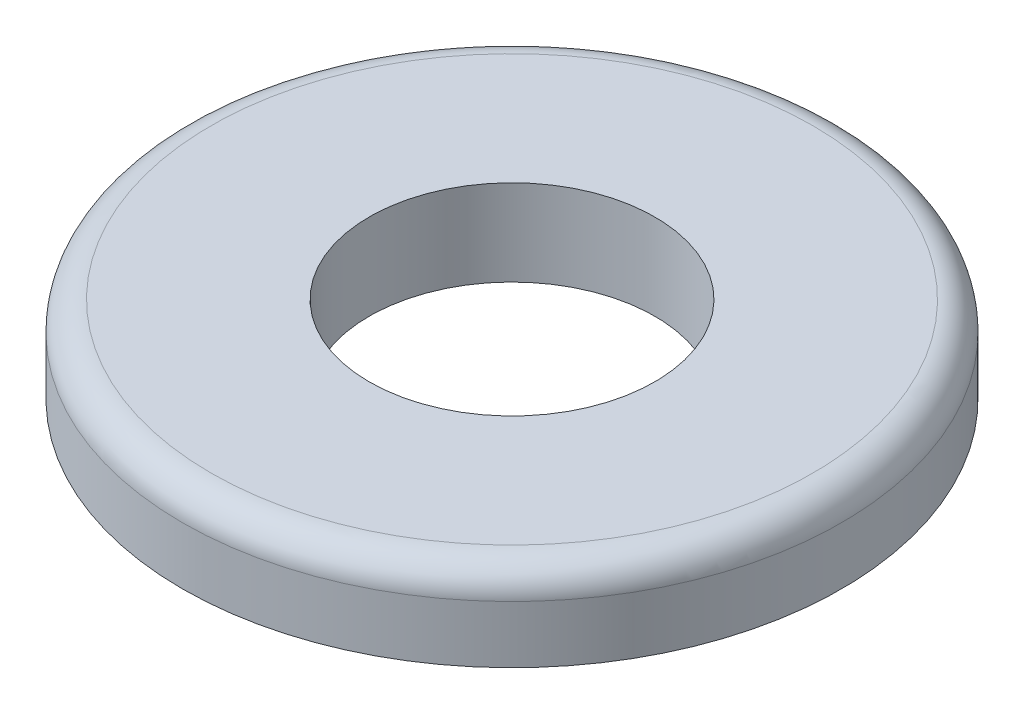
ISO-10303-21;
HEADER;
FILE_DESCRIPTION(('STEP AP214'),'2;1');
FILE_NAME('part.step','',(''),(''),'','','');
FILE_SCHEMA(('AUTOMOTIVE_DESIGN { 1 0 10303 214 1 1 1 1 }'));
ENDSEC;
DATA;
#1=APPLICATION_CONTEXT('core data for automotive mechanical design processes');
#2=APPLICATION_PROTOCOL_DEFINITION('international standard','automotive_design',2000,#1);
#3=PRODUCT_CONTEXT('',#1,'mechanical');
#4=PRODUCT('Part','Part','',(#3));
#5=PRODUCT_RELATED_PRODUCT_CATEGORY('part','',(#4));
#6=PRODUCT_DEFINITION_FORMATION('','',#4);
#7=PRODUCT_DEFINITION_CONTEXT('part definition',#1,'design');
#8=PRODUCT_DEFINITION('design','',#6,#7);
#9=PRODUCT_DEFINITION_SHAPE('','',#8);
#10=(LENGTH_UNIT() NAMED_UNIT(*) SI_UNIT(.MILLI.,.METRE.));
#11=(NAMED_UNIT(*) PLANE_ANGLE_UNIT() SI_UNIT($,.RADIAN.));
#12=(NAMED_UNIT(*) SI_UNIT($,.STERADIAN.) SOLID_ANGLE_UNIT());
#13=UNCERTAINTY_MEASURE_WITH_UNIT(LENGTH_MEASURE(1.E-05),#10,'distance_accuracy_value','');
#14=(GEOMETRIC_REPRESENTATION_CONTEXT(3) GLOBAL_UNCERTAINTY_ASSIGNED_CONTEXT((#13)) GLOBAL_UNIT_ASSIGNED_CONTEXT((#10,
#11,#12)) REPRESENTATION_CONTEXT('',''));
#15=CARTESIAN_POINT('',(0.,0.,0.));
#16=DIRECTION('',(0.,0.,1.));
#17=DIRECTION('',(1.,0.,0.));
#18=AXIS2_PLACEMENT_3D('',#15,#16,#17);
#19=CARTESIAN_POINT('',(0.,4.7625,0.));
#20=DIRECTION('',(0.,1.,0.));
#21=DIRECTION('',(0.,0.,1.));
#22=AXIS2_PLACEMENT_3D('',#19,#20,#21);
#23=PLANE('',#22);
#24=CARTESIAN_POINT('',(0.,4.7625,0.));
#25=DIRECTION('',(0.,1.,0.));
#26=DIRECTION('',(0.,0.,1.));
#27=AXIS2_PLACEMENT_3D('',#24,#25,#26);
#28=CIRCLE('',#27,16.66875);
#29=CARTESIAN_POINT('',(0.,4.7625,16.66875));
#30=VERTEX_POINT('',#29);
#31=EDGE_CURVE('E38',#30,#30,#28,.T.);
#32=ORIENTED_EDGE('',*,*,#31,.T.);
#33=EDGE_LOOP('',(#32));
#34=FACE_BOUND('',#33,.T.);
#35=CARTESIAN_POINT('',(0.,4.7625,0.));
#36=DIRECTION('',(0.,1.,0.));
#37=DIRECTION('',(0.,0.,1.));
#38=AXIS2_PLACEMENT_3D('',#35,#36,#37);
#39=CIRCLE('',#38,7.9121);
#40=CARTESIAN_POINT('',(0.,4.7625,7.9121));
#41=VERTEX_POINT('',#40);
#42=EDGE_CURVE('E46',#41,#41,#39,.T.);
#43=ORIENTED_EDGE('',*,*,#42,.F.);
#44=EDGE_LOOP('',(#43));
#45=FACE_BOUND('',#44,.T.);
#46=ADVANCED_FACE('F31',(#34,#45),#23,.T.);
#47=CARTESIAN_POINT('',(0.,0.,0.));
#48=DIRECTION('',(0.,1.,0.));
#49=DIRECTION('',(0.,0.,1.));
#50=AXIS2_PLACEMENT_3D('',#47,#48,#49);
#51=PLANE('',#50);
#52=CARTESIAN_POINT('',(0.,0.,0.));
#53=DIRECTION('',(0.,1.,0.));
#54=DIRECTION('',(0.,0.,1.));
#55=AXIS2_PLACEMENT_3D('',#52,#53,#54);
#56=CIRCLE('',#55,18.25625);
#57=CARTESIAN_POINT('',(0.,0.,18.25625));
#58=VERTEX_POINT('',#57);
#59=EDGE_CURVE('E42',#58,#58,#56,.T.);
#60=ORIENTED_EDGE('',*,*,#59,.F.);
#61=EDGE_LOOP('',(#60));
#62=FACE_BOUND('',#61,.T.);
#63=CARTESIAN_POINT('',(0.,0.,0.));
#64=DIRECTION('',(0.,1.,0.));
#65=DIRECTION('',(0.,0.,1.));
#66=AXIS2_PLACEMENT_3D('',#63,#64,#65);
#67=CIRCLE('',#66,7.9121);
#68=CARTESIAN_POINT('',(0.,0.,7.9121));
#69=VERTEX_POINT('',#68);
#70=EDGE_CURVE('E49',#69,#69,#67,.T.);
#71=ORIENTED_EDGE('',*,*,#70,.T.);
#72=EDGE_LOOP('',(#71));
#73=FACE_BOUND('',#72,.T.);
#74=ADVANCED_FACE('F59',(#62,#73),#51,.F.);
#75=CARTESIAN_POINT('',(0.,4.7625,0.));
#76=DIRECTION('',(0.,-1.,0.));
#77=DIRECTION('',(0.,0.,-1.));
#78=AXIS2_PLACEMENT_3D('',#75,#76,#77);
#79=CYLINDRICAL_SURFACE('',#78,18.25625);
#80=CARTESIAN_POINT('',(0.,3.175,0.));
#81=DIRECTION('',(0.,1.,0.));
#82=DIRECTION('',(0.,0.,1.));
#83=AXIS2_PLACEMENT_3D('',#80,#81,#82);
#84=CIRCLE('',#83,18.25625);
#85=CARTESIAN_POINT('',(0.,3.175,18.25625));
#86=VERTEX_POINT('',#85);
#87=EDGE_CURVE('E10',#86,#86,#84,.F.);
#88=ORIENTED_EDGE('',*,*,#87,.T.);
#89=EDGE_LOOP('',(#88));
#90=FACE_BOUND('',#89,.T.);
#91=ORIENTED_EDGE('',*,*,#59,.T.);
#92=EDGE_LOOP('',(#91));
#93=FACE_BOUND('',#92,.T.);
#94=ADVANCED_FACE('F64',(#90,#93),#79,.T.);
#95=CARTESIAN_POINT('',(0.,4.7625,0.));
#96=DIRECTION('',(0.,-1.,0.));
#97=DIRECTION('',(0.,0.,-1.));
#98=AXIS2_PLACEMENT_3D('',#95,#96,#97);
#99=CYLINDRICAL_SURFACE('',#98,7.9121);
#100=ORIENTED_EDGE('',*,*,#42,.T.);
#101=EDGE_LOOP('',(#100));
#102=FACE_BOUND('',#101,.T.);
#103=ORIENTED_EDGE('',*,*,#70,.F.);
#104=EDGE_LOOP('',(#103));
#105=FACE_BOUND('',#104,.T.);
#106=ADVANCED_FACE('F55',(#102,#105),#99,.F.);
#107=CARTESIAN_POINT('',(0.,3.175,0.));
#108=DIRECTION('',(0.,1.,0.));
#109=DIRECTION('',(0.,0.,1.));
#110=AXIS2_PLACEMENT_3D('',#107,#108,#109);
#111=TOROIDAL_SURFACE('',#110,16.66875,1.5875);
#112=ORIENTED_EDGE('',*,*,#87,.F.);
#113=EDGE_LOOP('',(#112));
#114=FACE_BOUND('',#113,.T.);
#115=ORIENTED_EDGE('',*,*,#31,.F.);
#116=EDGE_LOOP('',(#115));
#117=FACE_BOUND('',#116,.T.);
#118=ADVANCED_FACE('F33',(#114,#117),#111,.T.);
#119=CLOSED_SHELL('',(#46,#74,#94,#106,#118));
#120=MANIFOLD_SOLID_BREP('B2',#119);
#121=ADVANCED_BREP_SHAPE_REPRESENTATION('',(#18,#120),#14);
#122=SHAPE_DEFINITION_REPRESENTATION(#9,#121);
ENDSEC;
END-ISO-10303-21;
